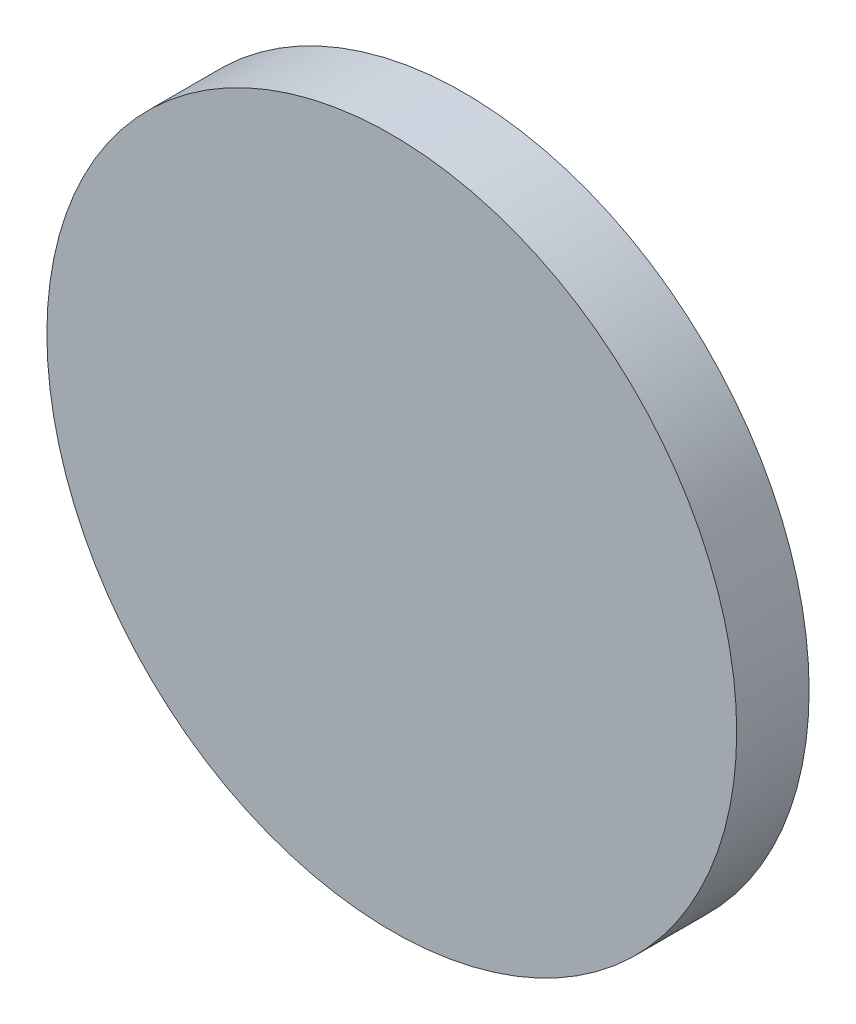
ISO-10303-21;
HEADER;
FILE_DESCRIPTION(('STEP AP214'),'2;1');
FILE_NAME('part.step','',(''),(''),'','','');
FILE_SCHEMA(('AUTOMOTIVE_DESIGN { 1 0 10303 214 1 1 1 1 }'));
ENDSEC;
DATA;
#1=APPLICATION_CONTEXT('core data for automotive mechanical design processes');
#2=APPLICATION_PROTOCOL_DEFINITION('international standard','automotive_design',2000,#1);
#3=PRODUCT_CONTEXT('',#1,'mechanical');
#4=PRODUCT('Part','Part','',(#3));
#5=PRODUCT_RELATED_PRODUCT_CATEGORY('part','',(#4));
#6=PRODUCT_DEFINITION_FORMATION('','',#4);
#7=PRODUCT_DEFINITION_CONTEXT('part definition',#1,'design');
#8=PRODUCT_DEFINITION('design','',#6,#7);
#9=PRODUCT_DEFINITION_SHAPE('','',#8);
#10=(LENGTH_UNIT() NAMED_UNIT(*) SI_UNIT(.MILLI.,.METRE.));
#11=(NAMED_UNIT(*) PLANE_ANGLE_UNIT() SI_UNIT($,.RADIAN.));
#12=(NAMED_UNIT(*) SI_UNIT($,.STERADIAN.) SOLID_ANGLE_UNIT());
#13=UNCERTAINTY_MEASURE_WITH_UNIT(LENGTH_MEASURE(1.E-05),#10,'distance_accuracy_value','');
#14=(GEOMETRIC_REPRESENTATION_CONTEXT(3) GLOBAL_UNCERTAINTY_ASSIGNED_CONTEXT((#13)) GLOBAL_UNIT_ASSIGNED_CONTEXT((#10,
#11,#12)) REPRESENTATION_CONTEXT('',''));
#15=CARTESIAN_POINT('',(0.,0.,0.));
#16=DIRECTION('',(0.,0.,1.));
#17=DIRECTION('',(1.,0.,0.));
#18=AXIS2_PLACEMENT_3D('',#15,#16,#17);
#19=CARTESIAN_POINT('',(0.,0.,4.));
#20=DIRECTION('',(0.,0.,-1.));
#21=DIRECTION('',(-1.,0.,0.));
#22=AXIS2_PLACEMENT_3D('',#19,#20,#21);
#23=CYLINDRICAL_SURFACE('',#22,19.05);
#24=CARTESIAN_POINT('',(0.,0.,4.));
#25=DIRECTION('',(0.,0.,1.));
#26=DIRECTION('',(1.,0.,0.));
#27=AXIS2_PLACEMENT_3D('',#24,#25,#26);
#28=CIRCLE('',#27,19.05);
#29=CARTESIAN_POINT('',(19.05,0.,4.));
#30=VERTEX_POINT('',#29);
#31=EDGE_CURVE('E10',#30,#30,#28,.T.);
#32=ORIENTED_EDGE('',*,*,#31,.F.);
#33=EDGE_LOOP('',(#32));
#34=FACE_BOUND('',#33,.T.);
#35=CARTESIAN_POINT('',(0.,0.,0.));
#36=DIRECTION('',(0.,0.,1.));
#37=DIRECTION('',(1.,0.,0.));
#38=AXIS2_PLACEMENT_3D('',#35,#36,#37);
#39=CIRCLE('',#38,19.05);
#40=CARTESIAN_POINT('',(19.05,0.,0.));
#41=VERTEX_POINT('',#40);
#42=EDGE_CURVE('E38',#41,#41,#39,.T.);
#43=ORIENTED_EDGE('',*,*,#42,.T.);
#44=EDGE_LOOP('',(#43));
#45=FACE_BOUND('',#44,.T.);
#46=ADVANCED_FACE('F35',(#34,#45),#23,.T.);
#47=CARTESIAN_POINT('',(0.,0.,4.));
#48=DIRECTION('',(0.,0.,1.));
#49=DIRECTION('',(1.,0.,0.));
#50=AXIS2_PLACEMENT_3D('',#47,#48,#49);
#51=PLANE('',#50);
#52=ORIENTED_EDGE('',*,*,#31,.T.);
#53=EDGE_LOOP('',(#52));
#54=FACE_BOUND('',#53,.T.);
#55=ADVANCED_FACE('F50',(#54),#51,.T.);
#56=CARTESIAN_POINT('',(0.,0.,0.));
#57=DIRECTION('',(0.,0.,1.));
#58=DIRECTION('',(1.,0.,0.));
#59=AXIS2_PLACEMENT_3D('',#56,#57,#58);
#60=PLANE('',#59);
#61=ORIENTED_EDGE('',*,*,#42,.F.);
#62=EDGE_LOOP('',(#61));
#63=FACE_BOUND('',#62,.T.);
#64=ADVANCED_FACE('F48',(#63),#60,.F.);
#65=CLOSED_SHELL('',(#46,#55,#64));
#66=MANIFOLD_SOLID_BREP('B2',#65);
#67=ADVANCED_BREP_SHAPE_REPRESENTATION('',(#18,#66),#14);
#68=SHAPE_DEFINITION_REPRESENTATION(#9,#67);
ENDSEC;
END-ISO-10303-21;
